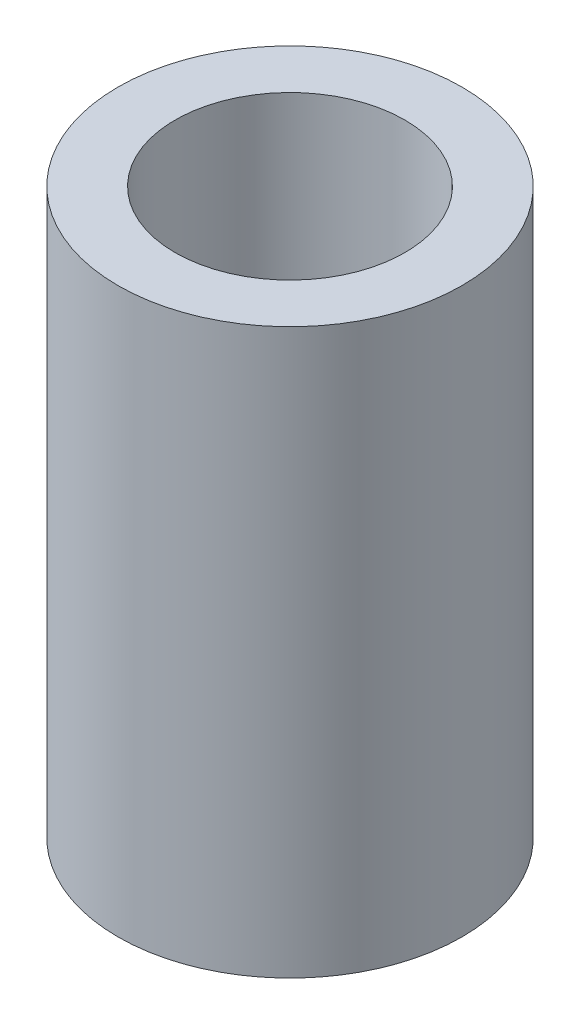
ISO-10303-21;
HEADER;
FILE_DESCRIPTION(('STEP AP214'),'2;1');
FILE_NAME('part.step','',(''),(''),'','','');
FILE_SCHEMA(('AUTOMOTIVE_DESIGN { 1 0 10303 214 1 1 1 1 }'));
ENDSEC;
DATA;
#1=APPLICATION_CONTEXT('core data for automotive mechanical design processes');
#2=APPLICATION_PROTOCOL_DEFINITION('international standard','automotive_design',2000,#1);
#3=PRODUCT_CONTEXT('',#1,'mechanical');
#4=PRODUCT('Part','Part','',(#3));
#5=PRODUCT_RELATED_PRODUCT_CATEGORY('part','',(#4));
#6=PRODUCT_DEFINITION_FORMATION('','',#4);
#7=PRODUCT_DEFINITION_CONTEXT('part definition',#1,'design');
#8=PRODUCT_DEFINITION('design','',#6,#7);
#9=PRODUCT_DEFINITION_SHAPE('','',#8);
#10=(LENGTH_UNIT() NAMED_UNIT(*) SI_UNIT(.MILLI.,.METRE.));
#11=(NAMED_UNIT(*) PLANE_ANGLE_UNIT() SI_UNIT($,.RADIAN.));
#12=(NAMED_UNIT(*) SI_UNIT($,.STERADIAN.) SOLID_ANGLE_UNIT());
#13=UNCERTAINTY_MEASURE_WITH_UNIT(LENGTH_MEASURE(1.E-05),#10,'distance_accuracy_value','');
#14=(GEOMETRIC_REPRESENTATION_CONTEXT(3) GLOBAL_UNCERTAINTY_ASSIGNED_CONTEXT((#13)) GLOBAL_UNIT_ASSIGNED_CONTEXT((#10,
#11,#12)) REPRESENTATION_CONTEXT('',''));
#15=CARTESIAN_POINT('',(0.,0.,0.));
#16=DIRECTION('',(0.,0.,1.));
#17=DIRECTION('',(1.,0.,0.));
#18=AXIS2_PLACEMENT_3D('',#15,#16,#17);
#19=CARTESIAN_POINT('',(0.,41.,0.));
#20=DIRECTION('',(0.,1.,0.));
#21=DIRECTION('',(0.,0.,1.));
#22=AXIS2_PLACEMENT_3D('',#19,#20,#21);
#23=PLANE('',#22);
#24=CARTESIAN_POINT('',(0.,41.,0.));
#25=DIRECTION('',(0.,1.,0.));
#26=DIRECTION('',(0.,0.,1.));
#27=AXIS2_PLACEMENT_3D('',#24,#25,#26);
#28=CIRCLE('',#27,25.);
#29=CARTESIAN_POINT('',(0.,41.,25.));
#30=VERTEX_POINT('',#29);
#31=EDGE_CURVE('E10',#30,#30,#28,.T.);
#32=ORIENTED_EDGE('',*,*,#31,.T.);
#33=EDGE_LOOP('',(#32));
#34=FACE_BOUND('',#33,.T.);
#35=CARTESIAN_POINT('',(0.,41.,0.));
#36=DIRECTION('',(0.,1.,0.));
#37=DIRECTION('',(0.,0.,1.));
#38=AXIS2_PLACEMENT_3D('',#35,#36,#37);
#39=CIRCLE('',#38,16.7);
#40=CARTESIAN_POINT('',(0.,41.,16.7));
#41=VERTEX_POINT('',#40);
#42=EDGE_CURVE('E41',#41,#41,#39,.T.);
#43=ORIENTED_EDGE('',*,*,#42,.F.);
#44=EDGE_LOOP('',(#43));
#45=FACE_BOUND('',#44,.T.);
#46=ADVANCED_FACE('F30',(#34,#45),#23,.T.);
#47=CARTESIAN_POINT('',(0.,-41.,0.));
#48=DIRECTION('',(0.,1.,0.));
#49=DIRECTION('',(0.,0.,1.));
#50=AXIS2_PLACEMENT_3D('',#47,#48,#49);
#51=PLANE('',#50);
#52=CARTESIAN_POINT('',(0.,-41.,0.));
#53=DIRECTION('',(0.,1.,0.));
#54=DIRECTION('',(0.,0.,1.));
#55=AXIS2_PLACEMENT_3D('',#52,#53,#54);
#56=CIRCLE('',#55,25.);
#57=CARTESIAN_POINT('',(0.,-41.,25.));
#58=VERTEX_POINT('',#57);
#59=EDGE_CURVE('E34',#58,#58,#56,.T.);
#60=ORIENTED_EDGE('',*,*,#59,.F.);
#61=EDGE_LOOP('',(#60));
#62=FACE_BOUND('',#61,.T.);
#63=CARTESIAN_POINT('',(0.,-41.,0.));
#64=DIRECTION('',(0.,1.,0.));
#65=DIRECTION('',(0.,0.,1.));
#66=AXIS2_PLACEMENT_3D('',#63,#64,#65);
#67=CIRCLE('',#66,16.7);
#68=CARTESIAN_POINT('',(0.,-41.,16.7));
#69=VERTEX_POINT('',#68);
#70=EDGE_CURVE('E43',#69,#69,#67,.T.);
#71=ORIENTED_EDGE('',*,*,#70,.T.);
#72=EDGE_LOOP('',(#71));
#73=FACE_BOUND('',#72,.T.);
#74=ADVANCED_FACE('F53',(#62,#73),#51,.F.);
#75=CARTESIAN_POINT('',(0.,41.,0.));
#76=DIRECTION('',(0.,-1.,0.));
#77=DIRECTION('',(0.,0.,-1.));
#78=AXIS2_PLACEMENT_3D('',#75,#76,#77);
#79=CYLINDRICAL_SURFACE('',#78,25.);
#80=ORIENTED_EDGE('',*,*,#31,.F.);
#81=EDGE_LOOP('',(#80));
#82=FACE_BOUND('',#81,.T.);
#83=ORIENTED_EDGE('',*,*,#59,.T.);
#84=EDGE_LOOP('',(#83));
#85=FACE_BOUND('',#84,.T.);
#86=ADVANCED_FACE('F32',(#82,#85),#79,.T.);
#87=CARTESIAN_POINT('',(0.,41.,0.));
#88=DIRECTION('',(0.,-1.,0.));
#89=DIRECTION('',(0.,0.,-1.));
#90=AXIS2_PLACEMENT_3D('',#87,#88,#89);
#91=CYLINDRICAL_SURFACE('',#90,16.7);
#92=ORIENTED_EDGE('',*,*,#42,.T.);
#93=EDGE_LOOP('',(#92));
#94=FACE_BOUND('',#93,.T.);
#95=ORIENTED_EDGE('',*,*,#70,.F.);
#96=EDGE_LOOP('',(#95));
#97=FACE_BOUND('',#96,.T.);
#98=ADVANCED_FACE('F49',(#94,#97),#91,.F.);
#99=CLOSED_SHELL('',(#46,#74,#86,#98));
#100=MANIFOLD_SOLID_BREP('B2',#99);
#101=ADVANCED_BREP_SHAPE_REPRESENTATION('',(#18,#100),#14);
#102=SHAPE_DEFINITION_REPRESENTATION(#9,#101);
ENDSEC;
END-ISO-10303-21;
